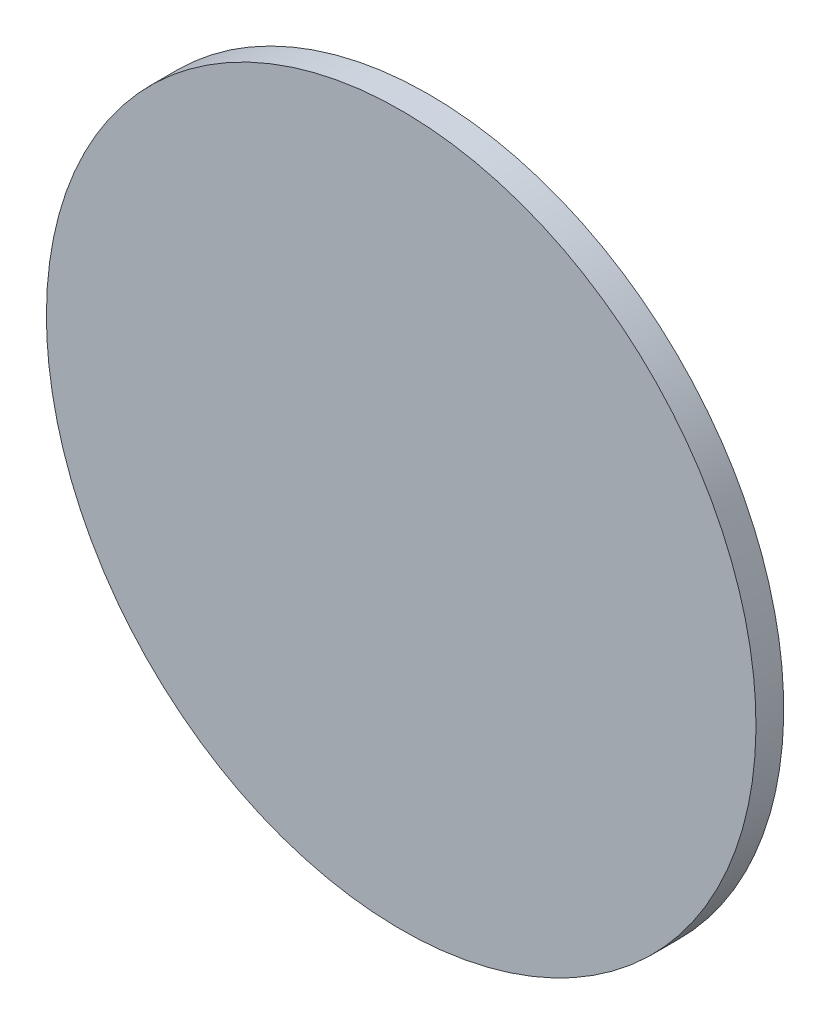
ISO-10303-21;
HEADER;
FILE_DESCRIPTION(('STEP AP214'),'2;1');
FILE_NAME('part.step','',(''),(''),'','','');
FILE_SCHEMA(('AUTOMOTIVE_DESIGN { 1 0 10303 214 1 1 1 1 }'));
ENDSEC;
DATA;
#1=APPLICATION_CONTEXT('core data for automotive mechanical design processes');
#2=APPLICATION_PROTOCOL_DEFINITION('international standard','automotive_design',2000,#1);
#3=PRODUCT_CONTEXT('',#1,'mechanical');
#4=PRODUCT('Part','Part','',(#3));
#5=PRODUCT_RELATED_PRODUCT_CATEGORY('part','',(#4));
#6=PRODUCT_DEFINITION_FORMATION('','',#4);
#7=PRODUCT_DEFINITION_CONTEXT('part definition',#1,'design');
#8=PRODUCT_DEFINITION('design','',#6,#7);
#9=PRODUCT_DEFINITION_SHAPE('','',#8);
#10=(LENGTH_UNIT() NAMED_UNIT(*) SI_UNIT(.MILLI.,.METRE.));
#11=(NAMED_UNIT(*) PLANE_ANGLE_UNIT() SI_UNIT($,.RADIAN.));
#12=(NAMED_UNIT(*) SI_UNIT($,.STERADIAN.) SOLID_ANGLE_UNIT());
#13=UNCERTAINTY_MEASURE_WITH_UNIT(LENGTH_MEASURE(1.E-05),#10,'distance_accuracy_value','');
#14=(GEOMETRIC_REPRESENTATION_CONTEXT(3) GLOBAL_UNCERTAINTY_ASSIGNED_CONTEXT((#13)) GLOBAL_UNIT_ASSIGNED_CONTEXT((#10,
#11,#12)) REPRESENTATION_CONTEXT('',''));
#15=CARTESIAN_POINT('',(0.,0.,0.));
#16=DIRECTION('',(0.,0.,1.));
#17=DIRECTION('',(1.,0.,0.));
#18=AXIS2_PLACEMENT_3D('',#15,#16,#17);
#19=CARTESIAN_POINT('',(0.440241672587601,2.89844450659126,-48.9946065262987));
#20=CARTESIAN_POINT('',(0.440241672587601,3.73970063010618,-48.9946065262987));
#21=CARTESIAN_POINT('',(0.605954664963182,5.42221287713601,-48.9946065262987));
#22=CARTESIAN_POINT('',(1.34211074460719,7.84899424454633,-48.9946065262987));
#23=CARTESIAN_POINT('',(2.53756335003221,10.0855287618273,-48.9946065262987));
#24=CARTESIAN_POINT('',(4.14637190802928,12.0458676617429,-48.9946065262987));
#25=CARTESIAN_POINT('',(6.10671080794483,13.6546762197399,-48.9946065262987));
#26=CARTESIAN_POINT('',(8.34324532522581,14.8501288251649,-48.9946065262987));
#27=CARTESIAN_POINT('',(10.7700266926361,15.586284904809,-48.9946065262987));
#28=CARTESIAN_POINT('',(13.2937950631809,15.8348543933723,-48.9946065262987));
#29=CARTESIAN_POINT('',(15.8175634337256,15.586284904809,-48.9946065262987));
#30=CARTESIAN_POINT('',(18.2443448011359,14.8501288251649,-48.9946065262987));
#31=CARTESIAN_POINT('',(20.4808793184169,13.6546762197399,-48.9946065262987));
#32=CARTESIAN_POINT('',(22.4412182183325,12.0458676617429,-48.9946065262987));
#33=CARTESIAN_POINT('',(24.0500267763295,10.0855287618273,-48.9946065262987));
#34=CARTESIAN_POINT('',(25.2454793817545,7.84899424454633,-48.9946065262987));
#35=CARTESIAN_POINT('',(25.9816354613986,5.42221287713601,-48.9946065262987));
#36=CARTESIAN_POINT('',(26.2302049499619,2.89844450659127,-48.9946065262987));
#37=CARTESIAN_POINT('',(25.9816354613986,0.374676136046518,-48.9946065262987));
#38=CARTESIAN_POINT('',(25.2454793817546,-2.05210523136379,-48.9946065262987));
#39=CARTESIAN_POINT('',(24.0500267763295,-4.28863974864477,-48.9946065262987));
#40=CARTESIAN_POINT('',(22.4412182183325,-6.24897864856032,-48.9946065262987));
#41=CARTESIAN_POINT('',(20.4808793184169,-7.8577872065574,-48.9946065262987));
#42=CARTESIAN_POINT('',(18.2443448011359,-9.05323981198241,-48.9946065262987));
#43=CARTESIAN_POINT('',(15.8175634337256,-9.78939589162643,-48.9946065262987));
#44=CARTESIAN_POINT('',(13.2937950631809,-10.0379653801898,-48.9946065262987));
#45=CARTESIAN_POINT('',(10.7700266926361,-9.78939589162642,-48.9946065262987));
#46=CARTESIAN_POINT('',(8.34324532522582,-9.05323981198241,-48.9946065262987));
#47=CARTESIAN_POINT('',(6.10671080794484,-7.8577872065574,-48.9946065262987));
#48=CARTESIAN_POINT('',(4.14637190802928,-6.24897864856033,-48.9946065262987));
#49=CARTESIAN_POINT('',(2.53756335003221,-4.28863974864478,-48.9946065262987));
#50=CARTESIAN_POINT('',(1.3421107446072,-2.0521052313638,-48.9946065262987));
#51=CARTESIAN_POINT('',(0.605954664963182,0.374676136046509,-48.9946065262987));
#52=CARTESIAN_POINT('',(0.440241672587601,2.05718838307635,-48.9946065262987));
#53=CARTESIAN_POINT('',(0.440241672587601,2.89844450659126,-48.9946065262987));
#54=B_SPLINE_CURVE_WITH_KNOTS('',3,(#19,#20,#21,#22,#23,#24,#25,#26,#27,#28,#29,#30,#31,#32,#33,
#34,#35,#36,#37,#38,#39,#40,#41,#42,#43,#44,#45,#46,#47,#48,#49,#50,#51,#52,#53),.UNSPECIFIED.,
.T.,.F.,(4,1,1,1,1,1,1,1,1,1,1,1,1,1,1,1,1,1,1,1,1,1,1,1,1,1,1,1,1,1,1,1,4),(0.,0.03125,0.0625,
0.09375,0.125,0.15625,0.1875,0.21875,0.25,0.28125,0.3125,0.34375,0.375,0.40625,0.4375,0.46875,
0.5,0.53125,0.5625,0.59375,0.625,0.65625,0.6875,0.71875,0.75,0.78125,0.8125,0.84375,0.875,
0.90625,0.9375,0.96875,1.),.UNSPECIFIED.);
#55=DIRECTION('',(0.,0.,-1.));
#56=VECTOR('',#55,1.);
#57=SURFACE_OF_LINEAR_EXTRUSION('',#54,#56);
#58=CARTESIAN_POINT('',(0.440241672587601,2.89844450659126,-48.9946065262987));
#59=CARTESIAN_POINT('',(0.440241672587601,3.73970063010618,-48.9946065262987));
#60=CARTESIAN_POINT('',(0.605954664963182,5.42221287713601,-48.9946065262987));
#61=CARTESIAN_POINT('',(1.34211074460719,7.84899424454633,-48.9946065262987));
#62=CARTESIAN_POINT('',(2.53756335003221,10.0855287618273,-48.9946065262987));
#63=CARTESIAN_POINT('',(4.14637190802928,12.0458676617429,-48.9946065262987));
#64=CARTESIAN_POINT('',(6.10671080794483,13.6546762197399,-48.9946065262987));
#65=CARTESIAN_POINT('',(8.34324532522581,14.8501288251649,-48.9946065262987));
#66=CARTESIAN_POINT('',(10.7700266926361,15.586284904809,-48.9946065262987));
#67=CARTESIAN_POINT('',(13.2937950631809,15.8348543933723,-48.9946065262987));
#68=CARTESIAN_POINT('',(15.8175634337256,15.586284904809,-48.9946065262987));
#69=CARTESIAN_POINT('',(18.2443448011359,14.8501288251649,-48.9946065262987));
#70=CARTESIAN_POINT('',(20.4808793184169,13.6546762197399,-48.9946065262987));
#71=CARTESIAN_POINT('',(22.4412182183325,12.0458676617429,-48.9946065262987));
#72=CARTESIAN_POINT('',(24.0500267763295,10.0855287618273,-48.9946065262987));
#73=CARTESIAN_POINT('',(25.2454793817545,7.84899424454633,-48.9946065262987));
#74=CARTESIAN_POINT('',(25.9816354613986,5.42221287713601,-48.9946065262987));
#75=CARTESIAN_POINT('',(26.2302049499619,2.89844450659127,-48.9946065262987));
#76=CARTESIAN_POINT('',(25.9816354613986,0.374676136046518,-48.9946065262987));
#77=CARTESIAN_POINT('',(25.2454793817546,-2.05210523136379,-48.9946065262987));
#78=CARTESIAN_POINT('',(24.0500267763295,-4.28863974864477,-48.9946065262987));
#79=CARTESIAN_POINT('',(22.4412182183325,-6.24897864856032,-48.9946065262987));
#80=CARTESIAN_POINT('',(20.4808793184169,-7.8577872065574,-48.9946065262987));
#81=CARTESIAN_POINT('',(18.2443448011359,-9.05323981198241,-48.9946065262987));
#82=CARTESIAN_POINT('',(15.8175634337256,-9.78939589162643,-48.9946065262987));
#83=CARTESIAN_POINT('',(13.2937950631809,-10.0379653801898,-48.9946065262987));
#84=CARTESIAN_POINT('',(10.7700266926361,-9.78939589162642,-48.9946065262987));
#85=CARTESIAN_POINT('',(8.34324532522582,-9.05323981198241,-48.9946065262987));
#86=CARTESIAN_POINT('',(6.10671080794484,-7.8577872065574,-48.9946065262987));
#87=CARTESIAN_POINT('',(4.14637190802928,-6.24897864856033,-48.9946065262987));
#88=CARTESIAN_POINT('',(2.53756335003221,-4.28863974864478,-48.9946065262987));
#89=CARTESIAN_POINT('',(1.3421107446072,-2.0521052313638,-48.9946065262987));
#90=CARTESIAN_POINT('',(0.605954664963182,0.374676136046509,-48.9946065262987));
#91=CARTESIAN_POINT('',(0.440241672587601,2.05718838307635,-48.9946065262987));
#92=CARTESIAN_POINT('',(0.440241672587601,2.89844450659126,-48.9946065262987));
#93=B_SPLINE_CURVE_WITH_KNOTS('',3,(#58,#59,#60,#61,#62,#63,#64,#65,#66,#67,#68,#69,#70,#71,#72,
#73,#74,#75,#76,#77,#78,#79,#80,#81,#82,#83,#84,#85,#86,#87,#88,#89,#90,#91,#92),.UNSPECIFIED.,
.T.,.F.,(4,1,1,1,1,1,1,1,1,1,1,1,1,1,1,1,1,1,1,1,1,1,1,1,1,1,1,1,1,1,1,1,4),(0.,0.03125,0.0625,
0.09375,0.125,0.15625,0.1875,0.21875,0.25,0.28125,0.3125,0.34375,0.375,0.40625,0.4375,0.46875,
0.5,0.53125,0.5625,0.59375,0.625,0.65625,0.6875,0.71875,0.75,0.78125,0.8125,0.84375,0.875,
0.90625,0.9375,0.96875,1.),.UNSPECIFIED.);
#94=CARTESIAN_POINT('',(0.440241672587601,2.89844450659126,-48.9946065262987));
#95=VERTEX_POINT('',#94);
#96=EDGE_CURVE('E9',#95,#95,#93,.T.);
#97=ORIENTED_EDGE('',*,*,#96,.T.);
#98=EDGE_LOOP('',(#97));
#99=FACE_BOUND('',#98,.T.);
#100=CARTESIAN_POINT('',(0.440241672587601,2.89844450659126,-49.9989999999932));
#101=CARTESIAN_POINT('',(0.44024171621153,2.6881291843083,-49.9989999999932));
#102=CARTESIAN_POINT('',(0.445420265443857,2.47781539267348,-49.9989999999932));
#103=CARTESIAN_POINT('',(0.466084594049892,2.05769294415229,-49.9989999999932));
#104=CARTESIAN_POINT('',(0.481570453488696,1.84788429120242,-49.9989999999932));
#105=CARTESIAN_POINT('',(0.522799619882937,1.42927747656596,-49.9989999999932));
#106=CARTESIAN_POINT('',(0.548542926838374,1.22047931487936,-49.9989999999932));
#107=CARTESIAN_POINT('',(0.610237549065363,0.804397555833782,-49.9989999999932));
#108=CARTESIAN_POINT('',(0.646188785041313,0.597113946722527,-49.9989999999932));
#109=CARTESIAN_POINT('',(0.728249408578597,0.184567326415313,-49.9989999999932));
#110=CARTESIAN_POINT('',(0.774358796139931,-0.0206956847806459,-49.9989999999932));
#111=CARTESIAN_POINT('',(0.876588004435237,-0.428714645221233,-49.9989999999932));
#112=CARTESIAN_POINT('',(0.93270790292635,-0.6314705749789,-49.9989999999932));
#113=CARTESIAN_POINT('',(1.05481096984659,-1.03399044311906,-49.9989999999932));
#114=CARTESIAN_POINT('',(1.12079413827573,-1.23375438150155,-49.9989999999932));
#115=CARTESIAN_POINT('',(1.26247684826425,-1.6298052553467,-49.9989999999932));
#116=CARTESIAN_POINT('',(1.33817631434456,-1.82609221780607,-49.9989999999932));
#117=CARTESIAN_POINT('',(1.49914401679683,-2.21470262821175,-49.9989999999932));
#118=CARTESIAN_POINT('',(1.5844122531688,-2.40702607615807,-49.9989999999932));
#119=CARTESIAN_POINT('',(1.76427770686699,-2.78726113987608,-49.9989999999932));
#120=CARTESIAN_POINT('',(1.85887499665454,-2.97517272136555,-49.9989999999932));
#121=CARTESIAN_POINT('',(2.05715961791624,-3.34613715583074,-49.9989999999932));
#122=CARTESIAN_POINT('',(2.16084694939039,-3.52919000880648,-49.9989999999932));
#123=CARTESIAN_POINT('',(2.37707295839063,-3.88998995081817,-49.9989999999932));
#124=CARTESIAN_POINT('',(2.48961156715474,-4.06773708105735,-49.9989999999932));
#125=CARTESIAN_POINT('',(2.7233004504337,-4.41747721044373,-49.9989999999932));
#126=CARTESIAN_POINT('',(2.84445072494855,-4.58947020959092,-49.9989999999932));
#127=CARTESIAN_POINT('',(3.09504029541441,-4.92730915390933,-49.9989999999932));
#128=CARTESIAN_POINT('',(3.2244796557463,-5.09315505132054,-49.9989999999932));
#129=CARTESIAN_POINT('',(3.49132586458563,-5.41830809758107,-49.9989999999932));
#130=CARTESIAN_POINT('',(3.62873271309308,-5.57761524643039,-49.9989999999932));
#131=CARTESIAN_POINT('',(3.91119257683153,-5.88929891700255,-49.9989999999932));
#132=CARTESIAN_POINT('',(4.05624553266015,-6.0416754925517,-49.9989999999932));
#133=CARTESIAN_POINT('',(4.35367506403791,-6.33910502392946,-49.9989999999932));
#134=CARTESIAN_POINT('',(4.50605163958706,-6.48415797975808,-49.9989999999932));
#135=CARTESIAN_POINT('',(4.81773531015923,-6.76661784349654,-49.9989999999932));
#136=CARTESIAN_POINT('',(4.97704245900855,-6.90402469200398,-49.9989999999932));
#137=CARTESIAN_POINT('',(5.30219550526907,-7.17087090084331,-49.9989999999932));
#138=CARTESIAN_POINT('',(5.46804140268025,-7.3003102611752,-49.9989999999932));
#139=CARTESIAN_POINT('',(5.80588034699872,-7.55089983164106,-49.9989999999932));
#140=CARTESIAN_POINT('',(5.97787334614601,-7.67205010615592,-49.9989999999932));
#141=CARTESIAN_POINT('',(6.32761347553214,-7.90573898943487,-49.9989999999932));
#142=CARTESIAN_POINT('',(6.50536060577099,-8.01827759819896,-49.9989999999932));
#143=CARTESIAN_POINT('',(6.86616054778359,-8.23450360719924,-49.9989999999932));
#144=CARTESIAN_POINT('',(7.04921340076056,-8.33819093867346,-49.9989999999932));
#145=CARTESIAN_POINT('',(7.42017783522238,-8.53647555993499,-49.9989999999932));
#146=CARTESIAN_POINT('',(7.60808941670725,-8.63107284972231,-49.9989999999932));
#147=CARTESIAN_POINT('',(7.98832448043784,-8.81093830342112,-49.9989999999932));
#148=CARTESIAN_POINT('',(8.18064792840135,-8.89620653979394,-49.9989999999932));
#149=CARTESIAN_POINT('',(8.56925833876007,-9.05717424224389,-49.9989999999932));
#150=CARTESIAN_POINT('',(8.76554530115528,-9.13287370832103,-49.9989999999932));
#151=CARTESIAN_POINT('',(9.1615961751757,-9.27455641831821,-49.9989999999932));
#152=CARTESIAN_POINT('',(9.36136011379762,-9.34053958675916,-49.9989999999932));
#153=CARTESIAN_POINT('',(9.76387998128365,-9.46264265364711,-49.9989999999932));
#154=CARTESIAN_POINT('',(9.96663591014775,-9.51876255209412,-49.9989999999932));
#155=CARTESIAN_POINT('',(10.3746548730296,-9.62099176050993,-49.9989999999932));
#156=CARTESIAN_POINT('',(10.5799178875603,-9.66710114823588,-49.9989999999932));
#157=CARTESIAN_POINT('',(10.9924644987568,-9.74916177132342,-49.9989999999932));
#158=CARTESIAN_POINT('',(11.1997480954225,-9.78511300668501,-49.9989999999932));
#159=CARTESIAN_POINT('',(11.61582988847,-9.84680763059047,-49.9989999999932));
#160=CARTESIAN_POINT('',(11.8246280966046,-9.87255093983876,-49.9989999999932));
#161=CARTESIAN_POINT('',(12.2432347843431,-9.91378009996882,-49.9989999999932));
#162=CARTESIAN_POINT('',(12.453043263947,-9.92926595085059,-49.9989999999932));
#163=CARTESIAN_POINT('',(12.8731661860562,-9.94993030283479,-49.9989999999932));
#164=CARTESIAN_POINT('',(13.0834806246185,-9.95510888400201,-49.9989999999932));
#165=CARTESIAN_POINT('',(13.5041095017432,-9.95510888400201,-49.9989999999932));
#166=CARTESIAN_POINT('',(13.7144239403056,-9.94993030283479,-49.9989999999932));
#167=CARTESIAN_POINT('',(14.1345468624148,-9.92926595085059,-49.9989999999932));
#168=CARTESIAN_POINT('',(14.3443553420187,-9.91378009996882,-49.9989999999932));
#169=CARTESIAN_POINT('',(14.7629620297572,-9.87255093983877,-49.9989999999932));
#170=CARTESIAN_POINT('',(14.9717602378917,-9.84680763059047,-49.9989999999932));
#171=CARTESIAN_POINT('',(15.3878420309393,-9.78511300668501,-49.9989999999932));
#172=CARTESIAN_POINT('',(15.595125627605,-9.74916177132342,-49.9989999999932));
#173=CARTESIAN_POINT('',(16.0076722388014,-9.66710114823588,-49.9989999999932));
#174=CARTESIAN_POINT('',(16.2129352533322,-9.62099176050993,-49.9989999999932));
#175=CARTESIAN_POINT('',(16.620954216214,-9.51876255209412,-49.9989999999932));
#176=CARTESIAN_POINT('',(16.8237101450781,-9.46264265364711,-49.9989999999932));
#177=CARTESIAN_POINT('',(17.2262300125641,-9.34053958675916,-49.9989999999932));
#178=CARTESIAN_POINT('',(17.4259939511861,-9.27455641831821,-49.9989999999932));
#179=CARTESIAN_POINT('',(17.8220448252065,-9.13287370832103,-49.9989999999932));
#180=CARTESIAN_POINT('',(18.0183317876017,-9.05717424224389,-49.9989999999932));
#181=CARTESIAN_POINT('',(18.4069421979604,-8.89620653979393,-49.9989999999932));
#182=CARTESIAN_POINT('',(18.5992656459239,-8.81093830342111,-49.9989999999932));
#183=CARTESIAN_POINT('',(18.9795007096545,-8.63107284972231,-49.9989999999932));
#184=CARTESIAN_POINT('',(19.1674122911394,-8.53647555993498,-49.9989999999932));
#185=CARTESIAN_POINT('',(19.5383767256012,-8.33819093867345,-49.9989999999932));
#186=CARTESIAN_POINT('',(19.7214295785782,-8.23450360719924,-49.9989999999932));
#187=CARTESIAN_POINT('',(20.0822295205908,-8.01827759819895,-49.9989999999932));
#188=CARTESIAN_POINT('',(20.2599766508296,-7.90573898943486,-49.9989999999932));
#189=CARTESIAN_POINT('',(20.6097167802157,-7.67205010615592,-49.9989999999932));
#190=CARTESIAN_POINT('',(20.781709779363,-7.55089983164106,-49.9989999999932));
#191=CARTESIAN_POINT('',(21.1195487236815,-7.3003102611752,-49.9989999999932));
#192=CARTESIAN_POINT('',(21.2853946210927,-7.17087090084331,-49.9989999999932));
#193=CARTESIAN_POINT('',(21.6105476673532,-6.90402469200398,-49.9989999999932));
#194=CARTESIAN_POINT('',(21.7698548162025,-6.76661784349653,-49.9989999999932));
#195=CARTESIAN_POINT('',(22.0815384867747,-6.48415797975808,-49.9989999999932));
#196=CARTESIAN_POINT('',(22.2339150623238,-6.33910502392946,-49.9989999999932));
#197=CARTESIAN_POINT('',(22.5313445937016,-6.0416754925517,-49.9989999999932));
#198=CARTESIAN_POINT('',(22.6763975495302,-5.88929891700255,-49.9989999999932));
#199=CARTESIAN_POINT('',(22.9588574132687,-5.57761524643038,-49.9989999999932));
#200=CARTESIAN_POINT('',(23.0962642617761,-5.41830809758106,-49.9989999999932));
#201=CARTESIAN_POINT('',(23.3631104706155,-5.09315505132055,-49.9989999999932));
#202=CARTESIAN_POINT('',(23.4925498309473,-4.92730915390936,-49.9989999999932));
#203=CARTESIAN_POINT('',(23.7431394014132,-4.58947020959089,-49.9989999999932));
#204=CARTESIAN_POINT('',(23.8642896759281,-4.4174772104436,-49.9989999999932));
#205=CARTESIAN_POINT('',(24.097978559207,-4.06773708105747,-49.9989999999932));
#206=CARTESIAN_POINT('',(24.2105171679711,-3.88998995081862,-49.9989999999932));
#207=CARTESIAN_POINT('',(24.4267431769714,-3.52919000880602,-49.9989999999932));
#208=CARTESIAN_POINT('',(24.5304305084456,-3.34613715582906,-49.9989999999932));
#209=CARTESIAN_POINT('',(24.7287151297071,-2.97517272136723,-49.9989999999932));
#210=CARTESIAN_POINT('',(24.8233124194945,-2.78726113988237,-49.9989999999932));
#211=CARTESIAN_POINT('',(25.0031778731933,-2.40702607615177,-49.9989999999932));
#212=CARTESIAN_POINT('',(25.0884461095661,-2.21470262818827,-49.9989999999932));
#213=CARTESIAN_POINT('',(25.249413812016,-1.82609221782955,-49.9989999999932));
#214=CARTESIAN_POINT('',(25.3251132780932,-1.62980525543433,-49.9989999999932));
#215=CARTESIAN_POINT('',(25.4667959880904,-1.23375438141391,-49.9989999999932));
#216=CARTESIAN_POINT('',(25.5327791565313,-1.03399044279199,-49.9989999999932));
#217=CARTESIAN_POINT('',(25.6548822234193,-0.631470575305962,-49.9989999999932));
#218=CARTESIAN_POINT('',(25.7110021218663,-0.428714646441855,-49.9989999999932));
#219=CARTESIAN_POINT('',(25.8132313302821,-0.0206956835600264,-49.9989999999932));
#220=CARTESIAN_POINT('',(25.859340718008,0.1845673309707,-49.9989999999932));
#221=CARTESIAN_POINT('',(25.9414013410956,0.59711394216715,-49.9989999999932));
#222=CARTESIAN_POINT('',(25.9773525764572,0.804397538832874,-49.9989999999932));
#223=CARTESIAN_POINT('',(26.0390472003626,1.22047933188041,-49.9989999999932));
#224=CARTESIAN_POINT('',(26.0647905096109,1.42927754001495,-49.9989999999932));
#225=CARTESIAN_POINT('',(26.106019669741,1.84788422775344,-49.9989999999932));
#226=CARTESIAN_POINT('',(26.1215055206227,2.05769270735738,-49.9989999999932));
#227=CARTESIAN_POINT('',(26.1421698726069,2.47781562946656,-49.9989999999932));
#228=CARTESIAN_POINT('',(26.1473484537741,2.68813006802891,-49.9989999999932));
#229=CARTESIAN_POINT('',(26.1473484537741,3.10875894515362,-49.9989999999932));
#230=CARTESIAN_POINT('',(26.1421698726069,3.31907338371597,-49.9989999999932));
#231=CARTESIAN_POINT('',(26.1215055206227,3.73919630582516,-49.9989999999932));
#232=CARTESIAN_POINT('',(26.106019669741,3.9490047854291,-49.9989999999932));
#233=CARTESIAN_POINT('',(26.0647905096109,4.36761147316758,-49.9989999999932));
#234=CARTESIAN_POINT('',(26.0390472003626,4.57640968130212,-49.9989999999932));
#235=CARTESIAN_POINT('',(25.9773525764572,4.99249147434965,-49.9989999999932));
#236=CARTESIAN_POINT('',(25.9414013410956,5.19977507101538,-49.9989999999932));
#237=CARTESIAN_POINT('',(25.859340718008,5.61232168221183,-49.9989999999932));
#238=CARTESIAN_POINT('',(25.8132313302821,5.81758469674256,-49.9989999999932));
#239=CARTESIAN_POINT('',(25.7110021218663,6.22560365962438,-49.9989999999932));
#240=CARTESIAN_POINT('',(25.6548822234192,6.42835958848849,-49.9989999999932));
#241=CARTESIAN_POINT('',(25.5327791565313,6.83087945597452,-49.9989999999932));
#242=CARTESIAN_POINT('',(25.4667959880904,7.03064339459644,-49.9989999999932));
#243=CARTESIAN_POINT('',(25.3251132780932,7.42669426861687,-49.9989999999932));
#244=CARTESIAN_POINT('',(25.249413812016,7.62298123101208,-49.9989999999932));
#245=CARTESIAN_POINT('',(25.0884461095661,8.0115916413708,-49.9989999999932));
#246=CARTESIAN_POINT('',(25.0031778731933,8.20391508933431,-49.9989999999932));
#247=CARTESIAN_POINT('',(24.8233124194944,8.5841501530649,-49.9989999999932));
#248=CARTESIAN_POINT('',(24.7287151297071,8.77206173454976,-49.9989999999932));
#249=CARTESIAN_POINT('',(24.5304305084456,9.14302616901159,-49.9989999999932));
#250=CARTESIAN_POINT('',(24.4267431769714,9.32607902198856,-49.9989999999932));
#251=CARTESIAN_POINT('',(24.2105171679711,9.68687896400116,-49.9989999999932));
#252=CARTESIAN_POINT('',(24.097978559207,9.86462609424,-49.9989999999932));
#253=CARTESIAN_POINT('',(23.8642896759281,10.2143662236261,-49.9989999999932));
#254=CARTESIAN_POINT('',(23.7431394014132,10.3863592227734,-49.9989999999932));
#255=CARTESIAN_POINT('',(23.4925498309473,10.7241981670919,-49.9989999999932));
#256=CARTESIAN_POINT('',(23.3631104706154,10.8900440645031,-49.9989999999932));
#257=CARTESIAN_POINT('',(23.0962642617761,11.2151971107636,-49.9989999999932));
#258=CARTESIAN_POINT('',(22.9588574132687,11.3745042596129,-49.9989999999932));
#259=CARTESIAN_POINT('',(22.6763975495302,11.6861879301851,-49.9989999999932));
#260=CARTESIAN_POINT('',(22.5313445937016,11.8385645057342,-49.9989999999932));
#261=CARTESIAN_POINT('',(22.2339150623238,12.135994037112,-49.9989999999932));
#262=CARTESIAN_POINT('',(22.0815384867747,12.2810469929406,-49.9989999999932));
#263=CARTESIAN_POINT('',(21.7698548162025,12.5635068566791,-49.9989999999932));
#264=CARTESIAN_POINT('',(21.6105476673532,12.7009137051865,-49.9989999999932));
#265=CARTESIAN_POINT('',(21.2853946210927,12.9677599140258,-49.9989999999932));
#266=CARTESIAN_POINT('',(21.1195487236815,13.0971992743577,-49.9989999999932));
#267=CARTESIAN_POINT('',(20.781709779363,13.3477888448236,-49.9989999999932));
#268=CARTESIAN_POINT('',(20.6097167802157,13.4689391193384,-49.9989999999932));
#269=CARTESIAN_POINT('',(20.2599766508296,13.7026280026174,-49.9989999999932));
#270=CARTESIAN_POINT('',(20.0822295205908,13.8151666113815,-49.9989999999932));
#271=CARTESIAN_POINT('',(19.7214295785782,14.0313926203818,-49.9989999999932));
#272=CARTESIAN_POINT('',(19.5383767256012,14.135079951856,-49.9989999999932));
#273=CARTESIAN_POINT('',(19.1674122911394,14.3333645731175,-49.9989999999932));
#274=CARTESIAN_POINT('',(18.9795007096545,14.4279618629048,-49.9989999999932));
#275=CARTESIAN_POINT('',(18.5992656459239,14.6078273166036,-49.9989999999932));
#276=CARTESIAN_POINT('',(18.4069421979604,14.6930955529765,-49.9989999999932));
#277=CARTESIAN_POINT('',(18.0183317876017,14.8540632554264,-49.9989999999932));
#278=CARTESIAN_POINT('',(17.8220448252065,14.9297627215036,-49.9989999999932));
#279=CARTESIAN_POINT('',(17.425993951186,15.0714454315007,-49.9989999999932));
#280=CARTESIAN_POINT('',(17.2262300125641,15.1374285999417,-49.9989999999932));
#281=CARTESIAN_POINT('',(16.8237101450781,15.2595316668296,-49.9989999999932));
#282=CARTESIAN_POINT('',(16.620954216214,15.3156515652766,-49.9989999999932));
#283=CARTESIAN_POINT('',(16.2129352533322,15.4178807736925,-49.9989999999932));
#284=CARTESIAN_POINT('',(16.0076722388014,15.4639901614184,-49.9989999999932));
#285=CARTESIAN_POINT('',(15.595125627605,15.546050784506,-49.9989999999932));
#286=CARTESIAN_POINT('',(15.3878420309393,15.5820020198675,-49.9989999999932));
#287=CARTESIAN_POINT('',(14.9717602378917,15.643696643773,-49.9989999999932));
#288=CARTESIAN_POINT('',(14.7629620297572,15.6694399530213,-49.9989999999932));
#289=CARTESIAN_POINT('',(14.3443553420187,15.7106691131514,-49.9989999999932));
#290=CARTESIAN_POINT('',(14.1345468624148,15.7261549640331,-49.9989999999932));
#291=CARTESIAN_POINT('',(13.7144239403056,15.7468193160173,-49.9989999999932));
#292=CARTESIAN_POINT('',(13.5041095017432,15.7519978971845,-49.9989999999932));
#293=CARTESIAN_POINT('',(13.0834806246185,15.7519978971845,-49.9989999999932));
#294=CARTESIAN_POINT('',(12.8731661860562,15.7468193160173,-49.9989999999932));
#295=CARTESIAN_POINT('',(12.453043263947,15.7261549640331,-49.9989999999932));
#296=CARTESIAN_POINT('',(12.243234784343,15.7106691131513,-49.9989999999932));
#297=CARTESIAN_POINT('',(11.8246280966046,15.6694399530213,-49.9989999999932));
#298=CARTESIAN_POINT('',(11.61582988847,15.643696643773,-49.9989999999932));
#299=CARTESIAN_POINT('',(11.1997480954225,15.5820020198675,-49.9989999999932));
#300=CARTESIAN_POINT('',(10.9924644987568,15.546050784506,-49.9989999999932));
#301=CARTESIAN_POINT('',(10.5799178875603,15.4639901614184,-49.9989999999932));
#302=CARTESIAN_POINT('',(10.3746548730296,15.4178807736925,-49.9989999999932));
#303=CARTESIAN_POINT('',(9.96663591014775,15.3156515652766,-49.9989999999932));
#304=CARTESIAN_POINT('',(9.76387998128365,15.2595316668296,-49.9989999999932));
#305=CARTESIAN_POINT('',(9.36136011379762,15.1374285999417,-49.9989999999932));
#306=CARTESIAN_POINT('',(9.1615961751757,15.0714454315007,-49.9989999999932));
#307=CARTESIAN_POINT('',(8.76554530115527,14.9297627215036,-49.9989999999932));
#308=CARTESIAN_POINT('',(8.56925833876006,14.8540632554264,-49.9989999999932));
#309=CARTESIAN_POINT('',(8.18064792840134,14.6930955529765,-49.9989999999932));
#310=CARTESIAN_POINT('',(7.98832448043783,14.6078273166036,-49.9989999999932));
#311=CARTESIAN_POINT('',(7.60808941670724,14.4279618629048,-49.9989999999932));
#312=CARTESIAN_POINT('',(7.42017783522238,14.3333645731175,-49.9989999999932));
#313=CARTESIAN_POINT('',(7.04921340076055,14.135079951856,-49.9989999999932));
#314=CARTESIAN_POINT('',(6.86616054778358,14.0313926203818,-49.9989999999932));
#315=CARTESIAN_POINT('',(6.50536060577099,13.8151666113815,-49.9989999999932));
#316=CARTESIAN_POINT('',(6.32761347553214,13.7026280026174,-49.9989999999932));
#317=CARTESIAN_POINT('',(5.977873346146,13.4689391193384,-49.9989999999932));
#318=CARTESIAN_POINT('',(5.80588034699872,13.3477888448236,-49.9989999999932));
#319=CARTESIAN_POINT('',(5.46804140268024,13.0971992743577,-49.9989999999932));
#320=CARTESIAN_POINT('',(5.30219550526906,12.9677599140258,-49.9989999999932));
#321=CARTESIAN_POINT('',(4.97704245900855,12.7009137051865,-49.9989999999932));
#322=CARTESIAN_POINT('',(4.81773531015922,12.5635068566791,-49.9989999999932));
#323=CARTESIAN_POINT('',(4.50605163958705,12.2810469929406,-49.9989999999932));
#324=CARTESIAN_POINT('',(4.35367506403791,12.135994037112,-49.9989999999932));
#325=CARTESIAN_POINT('',(4.05624553266015,11.8385645057342,-49.9989999999932));
#326=CARTESIAN_POINT('',(3.91119257683153,11.6861879301851,-49.9989999999932));
#327=CARTESIAN_POINT('',(3.62873271309308,11.3745042596129,-49.9989999999932));
#328=CARTESIAN_POINT('',(3.49132586458563,11.2151971107636,-49.9989999999932));
#329=CARTESIAN_POINT('',(3.2244796557463,10.8900440645031,-49.9989999999932));
#330=CARTESIAN_POINT('',(3.09504029541441,10.7241981670919,-49.9989999999932));
#331=CARTESIAN_POINT('',(2.84445072494855,10.3863592227735,-49.9989999999932));
#332=CARTESIAN_POINT('',(2.7233004504337,10.2143662236263,-49.9989999999932));
#333=CARTESIAN_POINT('',(2.48961156715474,9.86462609423988,-49.9989999999932));
#334=CARTESIAN_POINT('',(2.37707295839063,9.6868789640007,-49.9989999999932));
#335=CARTESIAN_POINT('',(2.16084694939039,9.326079021989,-49.9989999999932));
#336=CARTESIAN_POINT('',(2.05715961791624,9.14302616901327,-49.9989999999932));
#337=CARTESIAN_POINT('',(1.85887499665454,8.77206173454808,-49.9989999999932));
#338=CARTESIAN_POINT('',(1.76427770686699,8.58415015305861,-49.9989999999932));
#339=CARTESIAN_POINT('',(1.5844122531688,8.2039150893406,-49.9989999999932));
#340=CARTESIAN_POINT('',(1.49914401679683,8.01159164139428,-49.9989999999932));
#341=CARTESIAN_POINT('',(1.33817631434456,7.62298123098859,-49.9989999999932));
#342=CARTESIAN_POINT('',(1.26247684826425,7.42669426852923,-49.9989999999932));
#343=CARTESIAN_POINT('',(1.12079413827573,7.03064339468408,-49.9989999999932));
#344=CARTESIAN_POINT('',(1.05481096984659,6.83087945630158,-49.9989999999932));
#345=CARTESIAN_POINT('',(0.93270790292635,6.42835958816143,-49.9989999999932));
#346=CARTESIAN_POINT('',(0.876588004435237,6.22560365840376,-49.9989999999932));
#347=CARTESIAN_POINT('',(0.774358796139931,5.81758469796317,-49.9989999999932));
#348=CARTESIAN_POINT('',(0.728249408578597,5.61232168676721,-49.9989999999932));
#349=CARTESIAN_POINT('',(0.646188785041313,5.19977506646,-49.9989999999932));
#350=CARTESIAN_POINT('',(0.610237549065363,4.99249145734874,-49.9989999999932));
#351=CARTESIAN_POINT('',(0.548542926838374,4.57640969830317,-49.9989999999932));
#352=CARTESIAN_POINT('',(0.522799619882937,4.36761153661657,-49.9989999999932));
#353=CARTESIAN_POINT('',(0.481570453488696,3.94900472198011,-49.9989999999932));
#354=CARTESIAN_POINT('',(0.466084594049892,3.73919606903024,-49.9989999999932));
#355=CARTESIAN_POINT('',(0.445420265443857,3.31907362050905,-49.9989999999932));
#356=CARTESIAN_POINT('',(0.44024171621153,3.10875982887423,-49.9989999999932));
#357=CARTESIAN_POINT('',(0.440241672587601,2.89844450659126,-49.9989999999932));
#358=B_SPLINE_CURVE_WITH_KNOTS('',3,(#100,#101,#102,#103,#104,#105,#106,#107,#108,#109,#110,
#111,#112,#113,#114,#115,#116,#117,#118,#119,#120,#121,#122,#123,#124,#125,#126,#127,#128,#129,
#130,#131,#132,#133,#134,#135,#136,#137,#138,#139,#140,#141,#142,#143,#144,#145,#146,#147,#148,
#149,#150,#151,#152,#153,#154,#155,#156,#157,#158,#159,#160,#161,#162,#163,#164,#165,#166,#167,
#168,#169,#170,#171,#172,#173,#174,#175,#176,#177,#178,#179,#180,#181,#182,#183,#184,#185,#186,
#187,#188,#189,#190,#191,#192,#193,#194,#195,#196,#197,#198,#199,#200,#201,#202,#203,#204,#205,
#206,#207,#208,#209,#210,#211,#212,#213,#214,#215,#216,#217,#218,#219,#220,#221,#222,#223,#224,
#225,#226,#227,#228,#229,#230,#231,#232,#233,#234,#235,#236,#237,#238,#239,#240,#241,#242,#243,
#244,#245,#246,#247,#248,#249,#250,#251,#252,#253,#254,#255,#256,#257,#258,#259,#260,#261,#262,
#263,#264,#265,#266,#267,#268,#269,#270,#271,#272,#273,#274,#275,#276,#277,#278,#279,#280,#281,
#282,#283,#284,#285,#286,#287,#288,#289,#290,#291,#292,#293,#294,#295,#296,#297,#298,#299,#300,
#301,#302,#303,#304,#305,#306,#307,#308,#309,#310,#311,#312,#313,#314,#315,#316,#317,#318,#319,
#320,#321,#322,#323,#324,#325,#326,#327,#328,#329,#330,#331,#332,#333,#334,#335,#336,#337,#338,
#339,#340,#341,#342,#343,#344,#345,#346,#347,#348,#349,#350,#351,#352,#353,#354,#355,#356,#357),
.UNSPECIFIED.,.F.,.F.,(4,2,2,2,2,2,2,2,2,2,2,2,2,2,2,2,2,2,2,2,2,2,2,2,2,2,2,2,2,2,2,2,2,2,2,2,
2,2,2,2,2,2,2,2,2,2,2,2,2,2,2,2,2,2,2,2,2,2,2,2,2,2,2,2,2,2,2,2,2,2,2,2,2,2,2,2,2,2,2,2,2,2,2,2,
2,2,2,2,2,2,2,2,2,2,2,2,2,2,2,2,2,2,2,2,2,2,2,2,2,2,2,2,2,2,2,2,2,2,2,2,2,2,2,2,2,2,2,2,4),(0.,
0.630880223102108,1.26176534681108,1.89265047052006,2.52353069362217,3.15441091672427,
3.78529604043324,4.41618116414221,5.04706138724432,5.67794161034643,6.3088267340554,
6.93971185776437,7.57059208086648,8.20147230396859,8.83235742767756,9.46324255138653,
10.0941227744886,10.7250029975907,11.3558881212997,11.9867732450087,12.6176534681108,
13.2485336912129,13.8794188149219,14.5103039386309,15.141184161733,15.7720643848351,
16.402949508544,17.033834632253,17.6647148553551,18.2955950784572,18.9264802021662,
19.5573653258752,20.1882455489773,20.8191257720794,21.4500108957884,22.0808960194973,
22.7117762425994,23.3426564657015,23.9735415894105,24.6044267131195,25.2353069362216,
25.8661871593237,26.4970722830327,27.1279574067416,27.7588376298437,28.3897178529459,
29.0206029766548,29.6514881003638,30.2823683234659,30.913248546568,31.544133670277,
32.175018793986,32.8058990170881,33.4367792401902,34.0676643638991,34.6985494876081,
35.3294297107102,35.9603099338123,36.5911950575213,37.2220801812303,37.8529604043324,
38.4838406274345,39.1147257511435,39.7456108748524,40.3764910979545,41.0073713210566,
41.6382564447656,42.2691415684746,42.9000217915767,43.5309020146788,44.1617871383878,
44.7926722620967,45.4235524851988,46.054432708301,46.6853178320099,47.3162029557189,
47.947083178821,48.5779634019231,49.2088485256321,49.8397336493411,50.4706138724432,
51.1014940955453,51.7323792192542,52.3632643429632,52.9941445660653,53.6250247891674,
54.2559099128764,54.8867950365854,55.5176752596875,56.1485554827896,56.7794406064986,
57.4103257302075,58.0412059533096,58.6720861764117,59.3029713001207,59.9338564238297,
60.5647366469318,61.1956168700339,61.8265019937429,62.4573871174518,63.0882673405539,
63.7191475636561,64.350032687365,64.980917811074,65.6117980341761,66.2426782572782,
66.8735633809872,67.5044485046962,68.1353287277983,68.7662089509004,69.3970940746093,
70.0279791983183,70.6588594214204,71.2897396445225,71.9206247682315,72.5515098919405,
73.1823901150426,73.8132703381447,74.4441554618537,75.0750405855626,75.7059208086647,
76.3368010317668,76.9676861554758,77.5985712791848,78.2294515022869,78.860331725389,
79.491216849098,80.1221019728069,80.752982195909),.UNSPECIFIED.);
#359=CARTESIAN_POINT('',(0.440241672587601,2.89844450659126,-49.9989999999932));
#360=VERTEX_POINT('',#359);
#361=EDGE_CURVE('E24',#360,#360,#358,.F.);
#362=ORIENTED_EDGE('',*,*,#361,.F.);
#363=EDGE_LOOP('',(#362));
#364=FACE_BOUND('',#363,.T.);
#365=ADVANCED_FACE('F14',(#99,#364),#57,.T.);
#366=CARTESIAN_POINT('',(25.7937950631809,2.89844450659127,-48.9946065262987));
#367=DIRECTION('',(0.,0.,-1.));
#368=DIRECTION('',(0.,1.,0.));
#369=AXIS2_PLACEMENT_3D('',#366,#367,#368);
#370=PLANE('',#369);
#371=ORIENTED_EDGE('',*,*,#96,.F.);
#372=EDGE_LOOP('',(#371));
#373=FACE_BOUND('',#372,.T.);
#374=ADVANCED_FACE('F62',(#373),#370,.F.);
#375=CARTESIAN_POINT('',(25.7937950631809,2.89844450659127,-49.9989999999932));
#376=DIRECTION('',(0.,0.,-1.));
#377=DIRECTION('',(0.,1.,0.));
#378=AXIS2_PLACEMENT_3D('',#375,#376,#377);
#379=PLANE('',#378);
#380=ORIENTED_EDGE('',*,*,#361,.T.);
#381=EDGE_LOOP('',(#380));
#382=FACE_BOUND('',#381,.T.);
#383=ADVANCED_FACE('F31',(#382),#379,.T.);
#384=CLOSED_SHELL('',(#365,#374,#383));
#385=MANIFOLD_SOLID_BREP('B1',#384);
#386=ADVANCED_BREP_SHAPE_REPRESENTATION('',(#18,#385),#14);
#387=SHAPE_DEFINITION_REPRESENTATION(#9,#386);
ENDSEC;
END-ISO-10303-21;
